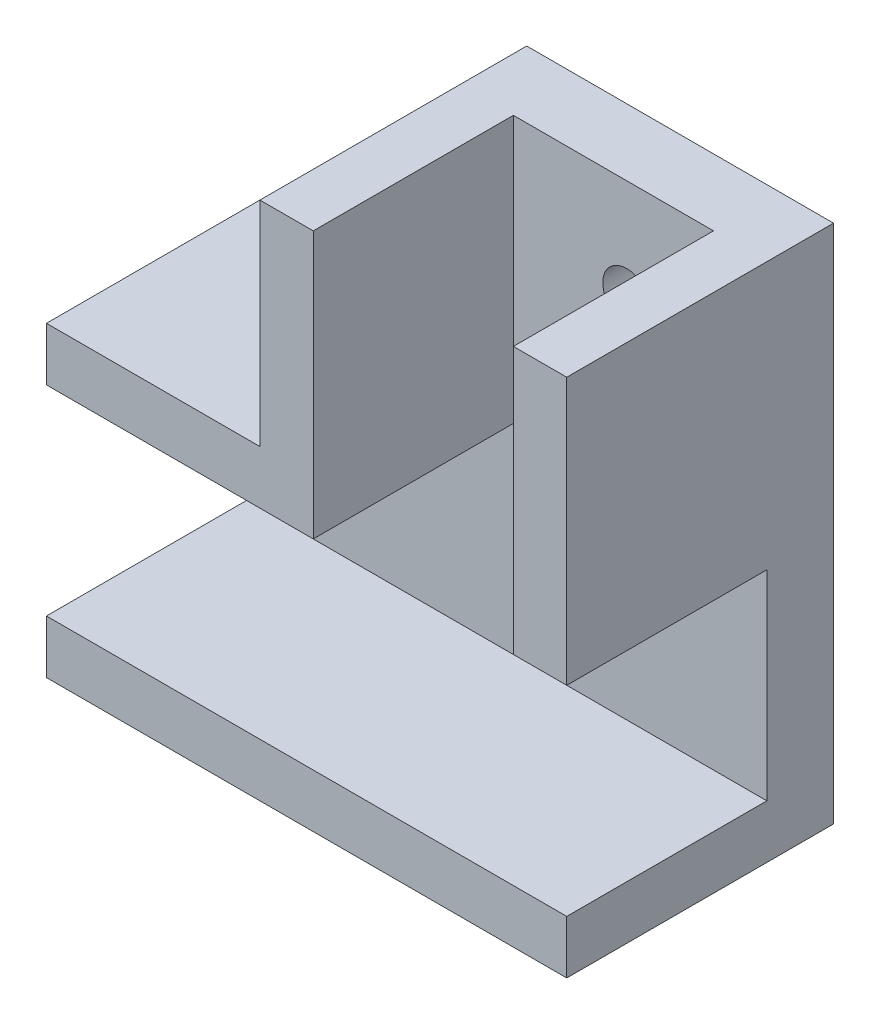
ISO-10303-21;
HEADER;
FILE_DESCRIPTION(('STEP AP214'),'2;1');
FILE_NAME('part.step','',(''),(''),'','','');
FILE_SCHEMA(('AUTOMOTIVE_DESIGN { 1 0 10303 214 1 1 1 1 }'));
ENDSEC;
DATA;
#1=APPLICATION_CONTEXT('core data for automotive mechanical design processes');
#2=APPLICATION_PROTOCOL_DEFINITION('international standard','automotive_design',2000,#1);
#3=PRODUCT_CONTEXT('',#1,'mechanical');
#4=PRODUCT('Part','Part','',(#3));
#5=PRODUCT_RELATED_PRODUCT_CATEGORY('part','',(#4));
#6=PRODUCT_DEFINITION_FORMATION('','',#4);
#7=PRODUCT_DEFINITION_CONTEXT('part definition',#1,'design');
#8=PRODUCT_DEFINITION('design','',#6,#7);
#9=PRODUCT_DEFINITION_SHAPE('','',#8);
#10=(LENGTH_UNIT() NAMED_UNIT(*) SI_UNIT(.MILLI.,.METRE.));
#11=(NAMED_UNIT(*) PLANE_ANGLE_UNIT() SI_UNIT($,.RADIAN.));
#12=(NAMED_UNIT(*) SI_UNIT($,.STERADIAN.) SOLID_ANGLE_UNIT());
#13=UNCERTAINTY_MEASURE_WITH_UNIT(LENGTH_MEASURE(1.E-05),#10,'distance_accuracy_value','');
#14=(GEOMETRIC_REPRESENTATION_CONTEXT(3) GLOBAL_UNCERTAINTY_ASSIGNED_CONTEXT((#13)) GLOBAL_UNIT_ASSIGNED_CONTEXT((#10,
#11,#12)) REPRESENTATION_CONTEXT('',''));
#15=CARTESIAN_POINT('',(0.,0.,0.));
#16=DIRECTION('',(0.,0.,1.));
#17=DIRECTION('',(1.,0.,0.));
#18=AXIS2_PLACEMENT_3D('',#15,#16,#17);
#19=CARTESIAN_POINT('',(0.,0.,20.));
#20=DIRECTION('',(0.,0.,-1.));
#21=DIRECTION('',(-1.,0.,0.));
#22=AXIS2_PLACEMENT_3D('',#19,#20,#21);
#23=PLANE('',#22);
#24=DIRECTION('',(0.,1.,0.));
#25=VECTOR('',#24,1.);
#26=CARTESIAN_POINT('',(14.3137254901961,15.7352941176471,20.));
#27=LINE('',#26,#25);
#28=CARTESIAN_POINT('',(14.3137254901961,-4.26470588235293,20.));
#29=VERTEX_POINT('',#28);
#30=CARTESIAN_POINT('',(14.3137254901961,15.7352941176471,20.));
#31=VERTEX_POINT('',#30);
#32=EDGE_CURVE('E163',#29,#31,#27,.T.);
#33=ORIENTED_EDGE('',*,*,#32,.F.);
#34=DIRECTION('',(-1.,0.,0.));
#35=VECTOR('',#34,1.);
#36=CARTESIAN_POINT('',(18.3137254901961,-4.26470588235293,20.));
#37=LINE('',#36,#35);
#38=CARTESIAN_POINT('',(18.3137254901961,-4.26470588235293,20.));
#39=VERTEX_POINT('',#38);
#40=EDGE_CURVE('E156',#39,#29,#37,.T.);
#41=ORIENTED_EDGE('',*,*,#40,.F.);
#42=DIRECTION('',(0.,-1.,0.));
#43=VECTOR('',#42,1.);
#44=CARTESIAN_POINT('',(18.3137254901961,15.7352941176471,20.));
#45=LINE('',#44,#43);
#46=CARTESIAN_POINT('',(18.3137254901961,15.7352941176471,20.));
#47=VERTEX_POINT('',#46);
#48=EDGE_CURVE('E169',#47,#39,#45,.T.);
#49=ORIENTED_EDGE('',*,*,#48,.F.);
#50=DIRECTION('',(1.,0.,0.));
#51=VECTOR('',#50,1.);
#52=CARTESIAN_POINT('',(14.3137254901961,15.7352941176471,20.));
#53=LINE('',#52,#51);
#54=EDGE_CURVE('E165',#31,#47,#53,.T.);
#55=ORIENTED_EDGE('',*,*,#54,.F.);
#56=EDGE_LOOP('',(#33,#41,#49,#55));
#57=FACE_BOUND('',#56,.T.);
#58=ADVANCED_FACE('F33',(#57),#23,.F.);
#59=CARTESIAN_POINT('',(-20.6862745098039,-4.26470588235294,5.));
#60=DIRECTION('',(1.,0.,0.));
#61=DIRECTION('',(0.,1.,0.));
#62=AXIS2_PLACEMENT_3D('',#59,#60,#61);
#63=PLANE('',#62);
#64=DIRECTION('',(0.,-1.,0.));
#65=VECTOR('',#64,1.);
#66=CARTESIAN_POINT('',(-20.6862745098039,-4.26470588235294,0.));
#67=LINE('',#66,#65);
#68=CARTESIAN_POINT('',(-20.6862745098039,-0.264705882352941,0.));
#69=VERTEX_POINT('',#68);
#70=CARTESIAN_POINT('',(-20.6862745098039,-23.2647058823529,0.));
#71=VERTEX_POINT('',#70);
#72=EDGE_CURVE('E234',#69,#71,#67,.T.);
#73=ORIENTED_EDGE('',*,*,#72,.T.);
#74=DIRECTION('',(0.,0.,-1.));
#75=VECTOR('',#74,1.);
#76=CARTESIAN_POINT('',(-20.6862745098039,-23.2647058823529,20.));
#77=LINE('',#76,#75);
#78=CARTESIAN_POINT('',(-20.6862745098039,-23.2647058823529,20.));
#79=VERTEX_POINT('',#78);
#80=EDGE_CURVE('E205',#79,#71,#77,.T.);
#81=ORIENTED_EDGE('',*,*,#80,.F.);
#82=DIRECTION('',(0.,1.,0.));
#83=VECTOR('',#82,1.);
#84=CARTESIAN_POINT('',(-20.6862745098039,-23.2647058823529,20.));
#85=LINE('',#84,#83);
#86=CARTESIAN_POINT('',(-20.6862745098039,-19.2647058823529,20.));
#87=VERTEX_POINT('',#86);
#88=EDGE_CURVE('E195',#79,#87,#85,.T.);
#89=ORIENTED_EDGE('',*,*,#88,.T.);
#90=DIRECTION('',(0.,0.,-1.));
#91=VECTOR('',#90,1.);
#92=CARTESIAN_POINT('',(-20.6862745098039,-19.2647058823529,20.));
#93=LINE('',#92,#91);
#94=CARTESIAN_POINT('',(-20.6862745098039,-19.2647058823529,5.));
#95=VERTEX_POINT('',#94);
#96=EDGE_CURVE('E202',#87,#95,#93,.T.);
#97=ORIENTED_EDGE('',*,*,#96,.T.);
#98=DIRECTION('',(0.,-1.,0.));
#99=VECTOR('',#98,1.);
#100=CARTESIAN_POINT('',(-20.6862745098039,-4.26470588235294,5.));
#101=LINE('',#100,#99);
#102=CARTESIAN_POINT('',(-20.6862745098039,-4.26470588235294,5.));
#103=VERTEX_POINT('',#102);
#104=EDGE_CURVE('E141',#103,#95,#101,.T.);
#105=ORIENTED_EDGE('',*,*,#104,.F.);
#106=DIRECTION('',(0.,0.,-1.));
#107=VECTOR('',#106,1.);
#108=CARTESIAN_POINT('',(-20.6862745098039,-4.26470588235294,20.));
#109=LINE('',#108,#107);
#110=CARTESIAN_POINT('',(-20.6862745098039,-4.26470588235294,20.));
#111=VERTEX_POINT('',#110);
#112=EDGE_CURVE('E231',#111,#103,#109,.T.);
#113=ORIENTED_EDGE('',*,*,#112,.F.);
#114=DIRECTION('',(0.,1.,0.));
#115=VECTOR('',#114,1.);
#116=CARTESIAN_POINT('',(-20.6862745098039,-4.26470588235294,20.));
#117=LINE('',#116,#115);
#118=CARTESIAN_POINT('',(-20.6862745098039,-0.264705882352941,20.));
#119=VERTEX_POINT('',#118);
#120=EDGE_CURVE('E210',#111,#119,#117,.T.);
#121=ORIENTED_EDGE('',*,*,#120,.T.);
#122=DIRECTION('',(0.,0.,-1.));
#123=VECTOR('',#122,1.);
#124=CARTESIAN_POINT('',(-20.6862745098039,-0.264705882352941,20.));
#125=LINE('',#124,#123);
#126=EDGE_CURVE('E226',#119,#69,#125,.T.);
#127=ORIENTED_EDGE('',*,*,#126,.T.);
#128=EDGE_LOOP('',(#73,#81,#89,#97,#105,#113,#121,#127));
#129=FACE_BOUND('',#128,.T.);
#130=ADVANCED_FACE('F35',(#129),#63,.F.);
#131=CARTESIAN_POINT('',(-0.686274509803913,15.7352941176471,5.));
#132=DIRECTION('',(0.,-1.,0.));
#133=DIRECTION('',(0.,0.,-1.));
#134=AXIS2_PLACEMENT_3D('',#131,#132,#133);
#135=PLANE('',#134);
#136=DIRECTION('',(-1.,0.,0.));
#137=VECTOR('',#136,1.);
#138=CARTESIAN_POINT('',(-0.686274509803913,15.7352941176471,0.));
#139=LINE('',#138,#137);
#140=CARTESIAN_POINT('',(18.3137254901961,15.7352941176471,0.));
#141=VERTEX_POINT('',#140);
#142=CARTESIAN_POINT('',(-4.68627450980391,15.7352941176471,0.));
#143=VERTEX_POINT('',#142);
#144=EDGE_CURVE('E37',#141,#143,#139,.T.);
#145=ORIENTED_EDGE('',*,*,#144,.T.);
#146=DIRECTION('',(0.,0.,-1.));
#147=VECTOR('',#146,1.);
#148=CARTESIAN_POINT('',(-4.68627450980391,15.7352941176471,20.));
#149=LINE('',#148,#147);
#150=CARTESIAN_POINT('',(-4.68627450980391,15.7352941176471,20.));
#151=VERTEX_POINT('',#150);
#152=EDGE_CURVE('E241',#151,#143,#149,.T.);
#153=ORIENTED_EDGE('',*,*,#152,.F.);
#154=DIRECTION('',(-1.,0.,0.));
#155=VECTOR('',#154,1.);
#156=CARTESIAN_POINT('',(-0.686274509803913,15.7352941176471,20.));
#157=LINE('',#156,#155);
#158=CARTESIAN_POINT('',(-0.686274509803913,15.7352941176471,20.));
#159=VERTEX_POINT('',#158);
#160=EDGE_CURVE('E219',#159,#151,#157,.T.);
#161=ORIENTED_EDGE('',*,*,#160,.F.);
#162=DIRECTION('',(0.,0.,-1.));
#163=VECTOR('',#162,1.);
#164=CARTESIAN_POINT('',(-0.686274509803913,15.7352941176471,20.));
#165=LINE('',#164,#163);
#166=CARTESIAN_POINT('',(-0.686274509803913,15.7352941176471,5.));
#167=VERTEX_POINT('',#166);
#168=EDGE_CURVE('E238',#159,#167,#165,.T.);
#169=ORIENTED_EDGE('',*,*,#168,.T.);
#170=DIRECTION('',(-1.,0.,0.));
#171=VECTOR('',#170,1.);
#172=CARTESIAN_POINT('',(-0.686274509803913,15.7352941176471,5.));
#173=LINE('',#172,#171);
#174=CARTESIAN_POINT('',(14.3137254901961,15.7352941176471,5.));
#175=VERTEX_POINT('',#174);
#176=EDGE_CURVE('E250',#175,#167,#173,.T.);
#177=ORIENTED_EDGE('',*,*,#176,.F.);
#178=DIRECTION('',(0.,0.,-1.));
#179=VECTOR('',#178,1.);
#180=CARTESIAN_POINT('',(14.3137254901961,15.7352941176471,20.));
#181=LINE('',#180,#179);
#182=EDGE_CURVE('E171',#31,#175,#181,.T.);
#183=ORIENTED_EDGE('',*,*,#182,.F.);
#184=ORIENTED_EDGE('',*,*,#54,.T.);
#185=DIRECTION('',(0.,0.,-1.));
#186=VECTOR('',#185,1.);
#187=CARTESIAN_POINT('',(18.3137254901961,15.7352941176471,20.));
#188=LINE('',#187,#186);
#189=EDGE_CURVE('E178',#47,#141,#188,.T.);
#190=ORIENTED_EDGE('',*,*,#189,.T.);
#191=EDGE_LOOP('',(#145,#153,#161,#169,#177,#183,#184,#190));
#192=FACE_BOUND('',#191,.T.);
#193=ADVANCED_FACE('F255',(#192),#135,.F.);
#194=CARTESIAN_POINT('',(0.,0.,5.));
#195=DIRECTION('',(0.,0.,1.));
#196=DIRECTION('',(1.,0.,0.));
#197=AXIS2_PLACEMENT_3D('',#194,#195,#196);
#198=PLANE('',#197);
#199=DIRECTION('',(0.,-1.,0.));
#200=VECTOR('',#199,1.);
#201=CARTESIAN_POINT('',(-0.686274509803913,15.7352941176471,5.));
#202=LINE('',#201,#200);
#203=CARTESIAN_POINT('',(-0.68627450980391,-4.26470588235294,5.));
#204=VERTEX_POINT('',#203);
#205=EDGE_CURVE('E42',#167,#204,#202,.T.);
#206=ORIENTED_EDGE('',*,*,#205,.T.);
#207=DIRECTION('',(-1.,0.,0.));
#208=VECTOR('',#207,1.);
#209=CARTESIAN_POINT('',(-20.6862745098039,-4.26470588235294,5.));
#210=LINE('',#209,#208);
#211=EDGE_CURVE('E11',#204,#103,#210,.T.);
#212=ORIENTED_EDGE('',*,*,#211,.T.);
#213=ORIENTED_EDGE('',*,*,#104,.T.);
#214=DIRECTION('',(1.,0.,0.));
#215=VECTOR('',#214,1.);
#216=CARTESIAN_POINT('',(-20.6862745098039,-19.2647058823529,5.));
#217=LINE('',#216,#215);
#218=CARTESIAN_POINT('',(18.3137254901961,-19.2647058823529,5.));
#219=VERTEX_POINT('',#218);
#220=EDGE_CURVE('E134',#95,#219,#217,.T.);
#221=ORIENTED_EDGE('',*,*,#220,.T.);
#222=DIRECTION('',(0.,-1.,0.));
#223=VECTOR('',#222,1.);
#224=CARTESIAN_POINT('',(18.3137254901961,-4.26470588235293,5.));
#225=LINE('',#224,#223);
#226=CARTESIAN_POINT('',(18.3137254901961,-4.26470588235293,5.));
#227=VERTEX_POINT('',#226);
#228=EDGE_CURVE('E139',#227,#219,#225,.T.);
#229=ORIENTED_EDGE('',*,*,#228,.F.);
#230=DIRECTION('',(-1.,0.,0.));
#231=VECTOR('',#230,1.);
#232=CARTESIAN_POINT('',(18.3137254901961,-4.26470588235293,5.));
#233=LINE('',#232,#231);
#234=CARTESIAN_POINT('',(14.3137254901961,-4.26470588235293,5.));
#235=VERTEX_POINT('',#234);
#236=EDGE_CURVE('E157',#227,#235,#233,.T.);
#237=ORIENTED_EDGE('',*,*,#236,.T.);
#238=DIRECTION('',(0.,1.,0.));
#239=VECTOR('',#238,1.);
#240=CARTESIAN_POINT('',(14.3137254901961,-4.26470588235294,5.));
#241=LINE('',#240,#239);
#242=EDGE_CURVE('E143',#235,#175,#241,.T.);
#243=ORIENTED_EDGE('',*,*,#242,.T.);
#244=ORIENTED_EDGE('',*,*,#176,.T.);
#245=EDGE_LOOP('',(#206,#212,#213,#221,#229,#237,#243,#244));
#246=FACE_BOUND('',#245,.T.);
#247=CARTESIAN_POINT('',(7.81372549019609,8.23529411764706,5.));
#248=DIRECTION('',(0.,0.,1.));
#249=DIRECTION('',(1.,0.,0.));
#250=AXIS2_PLACEMENT_3D('',#247,#248,#249);
#251=CIRCLE('',#250,1.8);
#252=CARTESIAN_POINT('',(9.61372549019609,8.23529411764706,5.));
#253=VERTEX_POINT('',#252);
#254=EDGE_CURVE('E187',#253,#253,#251,.T.);
#255=ORIENTED_EDGE('',*,*,#254,.F.);
#256=EDGE_LOOP('',(#255));
#257=FACE_BOUND('',#256,.T.);
#258=CARTESIAN_POINT('',(-13.1862745098039,-11.7647058823529,5.));
#259=DIRECTION('',(0.,0.,1.));
#260=DIRECTION('',(1.,0.,0.));
#261=AXIS2_PLACEMENT_3D('',#258,#259,#260);
#262=CIRCLE('',#261,1.8);
#263=CARTESIAN_POINT('',(-11.3862745098039,-11.7647058823529,5.));
#264=VERTEX_POINT('',#263);
#265=EDGE_CURVE('E177',#264,#264,#262,.T.);
#266=ORIENTED_EDGE('',*,*,#265,.F.);
#267=EDGE_LOOP('',(#266));
#268=FACE_BOUND('',#267,.T.);
#269=ADVANCED_FACE('F135',(#246,#257,#268),#198,.T.);
#270=CARTESIAN_POINT('',(0.,0.,0.));
#271=DIRECTION('',(0.,0.,1.));
#272=DIRECTION('',(1.,0.,0.));
#273=AXIS2_PLACEMENT_3D('',#270,#271,#272);
#274=PLANE('',#273);
#275=CARTESIAN_POINT('',(7.81372549019609,8.23529411764706,0.));
#276=DIRECTION('',(0.,0.,1.));
#277=DIRECTION('',(1.,0.,0.));
#278=AXIS2_PLACEMENT_3D('',#275,#276,#277);
#279=CIRCLE('',#278,1.8);
#280=CARTESIAN_POINT('',(9.61372549019609,8.23529411764706,0.));
#281=VERTEX_POINT('',#280);
#282=EDGE_CURVE('E183',#281,#281,#279,.T.);
#283=ORIENTED_EDGE('',*,*,#282,.T.);
#284=EDGE_LOOP('',(#283));
#285=FACE_BOUND('',#284,.T.);
#286=CARTESIAN_POINT('',(-13.1862745098039,-11.7647058823529,0.));
#287=DIRECTION('',(0.,0.,1.));
#288=DIRECTION('',(1.,0.,0.));
#289=AXIS2_PLACEMENT_3D('',#286,#287,#288);
#290=CIRCLE('',#289,1.8);
#291=CARTESIAN_POINT('',(-11.3862745098039,-11.7647058823529,0.));
#292=VERTEX_POINT('',#291);
#293=EDGE_CURVE('E190',#292,#292,#290,.T.);
#294=ORIENTED_EDGE('',*,*,#293,.T.);
#295=EDGE_LOOP('',(#294));
#296=FACE_BOUND('',#295,.T.);
#297=ORIENTED_EDGE('',*,*,#72,.F.);
#298=DIRECTION('',(1.,0.,0.));
#299=VECTOR('',#298,1.);
#300=CARTESIAN_POINT('',(-6.07997052750672,-0.264705882352943,0.));
#301=LINE('',#300,#299);
#302=CARTESIAN_POINT('',(-4.68627450980391,-0.264705882352945,0.));
#303=VERTEX_POINT('',#302);
#304=EDGE_CURVE('E208',#69,#303,#301,.T.);
#305=ORIENTED_EDGE('',*,*,#304,.T.);
#306=DIRECTION('',(0.,-1.,0.));
#307=VECTOR('',#306,1.);
#308=CARTESIAN_POINT('',(-4.68627450980391,15.7352941176471,0.));
#309=LINE('',#308,#307);
#310=EDGE_CURVE('E214',#143,#303,#309,.T.);
#311=ORIENTED_EDGE('',*,*,#310,.F.);
#312=ORIENTED_EDGE('',*,*,#144,.F.);
#313=DIRECTION('',(0.,-1.,0.));
#314=VECTOR('',#313,1.);
#315=CARTESIAN_POINT('',(18.3137254901961,15.7352941176471,0.));
#316=LINE('',#315,#314);
#317=CARTESIAN_POINT('',(18.3137254901961,-23.2647058823529,0.));
#318=VERTEX_POINT('',#317);
#319=EDGE_CURVE('E162',#141,#318,#316,.T.);
#320=ORIENTED_EDGE('',*,*,#319,.T.);
#321=DIRECTION('',(-1.,0.,0.));
#322=VECTOR('',#321,1.);
#323=CARTESIAN_POINT('',(14.3137254901961,-23.2647058823529,0.));
#324=LINE('',#323,#322);
#325=EDGE_CURVE('E186',#318,#71,#324,.T.);
#326=ORIENTED_EDGE('',*,*,#325,.T.);
#327=EDGE_LOOP('',(#297,#305,#311,#312,#320,#326));
#328=FACE_BOUND('',#327,.T.);
#329=ADVANCED_FACE('F264',(#285,#296,#328),#274,.F.);
#330=CARTESIAN_POINT('',(-20.6862745098039,-4.26470588235294,20.));
#331=DIRECTION('',(0.,1.,0.));
#332=DIRECTION('',(-1.,0.,0.));
#333=AXIS2_PLACEMENT_3D('',#330,#331,#332);
#334=PLANE('',#333);
#335=ORIENTED_EDGE('',*,*,#211,.F.);
#336=DIRECTION('',(0.,0.,-1.));
#337=VECTOR('',#336,1.);
#338=CARTESIAN_POINT('',(-0.686274509803916,-4.26470588235294,20.));
#339=LINE('',#338,#337);
#340=CARTESIAN_POINT('',(-0.686274509803916,-4.26470588235294,20.));
#341=VERTEX_POINT('',#340);
#342=EDGE_CURVE('E235',#341,#204,#339,.T.);
#343=ORIENTED_EDGE('',*,*,#342,.F.);
#344=DIRECTION('',(1.,0.,0.));
#345=VECTOR('',#344,1.);
#346=CARTESIAN_POINT('',(-20.6862745098039,-4.26470588235294,20.));
#347=LINE('',#346,#345);
#348=EDGE_CURVE('E224',#111,#341,#347,.T.);
#349=ORIENTED_EDGE('',*,*,#348,.F.);
#350=ORIENTED_EDGE('',*,*,#112,.T.);
#351=EDGE_LOOP('',(#335,#343,#349,#350));
#352=FACE_BOUND('',#351,.T.);
#353=ADVANCED_FACE('F281',(#352),#334,.F.);
#354=CARTESIAN_POINT('',(-0.686274509803913,15.7352941176471,20.));
#355=DIRECTION('',(1.,0.,0.));
#356=DIRECTION('',(0.,1.,0.));
#357=AXIS2_PLACEMENT_3D('',#354,#355,#356);
#358=PLANE('',#357);
#359=ORIENTED_EDGE('',*,*,#342,.T.);
#360=ORIENTED_EDGE('',*,*,#205,.F.);
#361=ORIENTED_EDGE('',*,*,#168,.F.);
#362=DIRECTION('',(0.,-1.,0.));
#363=VECTOR('',#362,1.);
#364=CARTESIAN_POINT('',(-0.686274509803913,15.7352941176471,20.));
#365=LINE('',#364,#363);
#366=EDGE_CURVE('E221',#159,#341,#365,.T.);
#367=ORIENTED_EDGE('',*,*,#366,.T.);
#368=EDGE_LOOP('',(#359,#360,#361,#367));
#369=FACE_BOUND('',#368,.T.);
#370=ADVANCED_FACE('F279',(#369),#358,.T.);
#371=CARTESIAN_POINT('',(-4.68627450980391,15.7352941176471,20.));
#372=DIRECTION('',(1.,0.,0.));
#373=DIRECTION('',(0.,1.,0.));
#374=AXIS2_PLACEMENT_3D('',#371,#372,#373);
#375=PLANE('',#374);
#376=ORIENTED_EDGE('',*,*,#310,.T.);
#377=DIRECTION('',(0.,0.,-1.));
#378=VECTOR('',#377,1.);
#379=CARTESIAN_POINT('',(-4.68627450980391,-0.264705882352945,20.));
#380=LINE('',#379,#378);
#381=CARTESIAN_POINT('',(-4.68627450980391,-0.264705882352945,20.));
#382=VERTEX_POINT('',#381);
#383=EDGE_CURVE('E244',#382,#303,#380,.T.);
#384=ORIENTED_EDGE('',*,*,#383,.F.);
#385=DIRECTION('',(0.,-1.,0.));
#386=VECTOR('',#385,1.);
#387=CARTESIAN_POINT('',(-4.68627450980391,15.7352941176471,20.));
#388=LINE('',#387,#386);
#389=EDGE_CURVE('E216',#151,#382,#388,.T.);
#390=ORIENTED_EDGE('',*,*,#389,.F.);
#391=ORIENTED_EDGE('',*,*,#152,.T.);
#392=EDGE_LOOP('',(#376,#384,#390,#391));
#393=FACE_BOUND('',#392,.T.);
#394=ADVANCED_FACE('F262',(#393),#375,.F.);
#395=CARTESIAN_POINT('',(-6.07997052750672,-0.264705882352943,20.));
#396=DIRECTION('',(0.,1.,0.));
#397=DIRECTION('',(-1.,0.,0.));
#398=AXIS2_PLACEMENT_3D('',#395,#396,#397);
#399=PLANE('',#398);
#400=ORIENTED_EDGE('',*,*,#304,.F.);
#401=ORIENTED_EDGE('',*,*,#126,.F.);
#402=DIRECTION('',(1.,0.,0.));
#403=VECTOR('',#402,1.);
#404=CARTESIAN_POINT('',(-20.6862745098039,-0.264705882352941,20.));
#405=LINE('',#404,#403);
#406=EDGE_CURVE('E213',#119,#382,#405,.T.);
#407=ORIENTED_EDGE('',*,*,#406,.T.);
#408=ORIENTED_EDGE('',*,*,#383,.T.);
#409=EDGE_LOOP('',(#400,#401,#407,#408));
#410=FACE_BOUND('',#409,.T.);
#411=ADVANCED_FACE('F267',(#410),#399,.T.);
#412=CARTESIAN_POINT('',(0.,0.,20.));
#413=DIRECTION('',(0.,0.,-1.));
#414=DIRECTION('',(-1.,0.,0.));
#415=AXIS2_PLACEMENT_3D('',#412,#413,#414);
#416=PLANE('',#415);
#417=ORIENTED_EDGE('',*,*,#120,.F.);
#418=ORIENTED_EDGE('',*,*,#348,.T.);
#419=ORIENTED_EDGE('',*,*,#366,.F.);
#420=ORIENTED_EDGE('',*,*,#160,.T.);
#421=ORIENTED_EDGE('',*,*,#389,.T.);
#422=ORIENTED_EDGE('',*,*,#406,.F.);
#423=EDGE_LOOP('',(#417,#418,#419,#420,#421,#422));
#424=FACE_BOUND('',#423,.T.);
#425=ADVANCED_FACE('F272',(#424),#416,.F.);
#426=CARTESIAN_POINT('',(-20.6862745098039,-19.2647058823529,20.));
#427=DIRECTION('',(0.,1.,0.));
#428=DIRECTION('',(0.,0.,1.));
#429=AXIS2_PLACEMENT_3D('',#426,#427,#428);
#430=PLANE('',#429);
#431=ORIENTED_EDGE('',*,*,#220,.F.);
#432=ORIENTED_EDGE('',*,*,#96,.F.);
#433=DIRECTION('',(1.,0.,0.));
#434=VECTOR('',#433,1.);
#435=CARTESIAN_POINT('',(-20.6862745098039,-19.2647058823529,20.));
#436=LINE('',#435,#434);
#437=CARTESIAN_POINT('',(18.3137254901961,-19.2647058823529,20.));
#438=VERTEX_POINT('',#437);
#439=EDGE_CURVE('E50',#87,#438,#436,.T.);
#440=ORIENTED_EDGE('',*,*,#439,.T.);
#441=DIRECTION('',(0.,0.,1.));
#442=VECTOR('',#441,1.);
#443=CARTESIAN_POINT('',(18.3137254901961,-19.2647058823529,5.));
#444=LINE('',#443,#442);
#445=EDGE_CURVE('E145',#219,#438,#444,.T.);
#446=ORIENTED_EDGE('',*,*,#445,.F.);
#447=EDGE_LOOP('',(#431,#432,#440,#446));
#448=FACE_BOUND('',#447,.T.);
#449=ADVANCED_FACE('F146',(#448),#430,.T.);
#450=CARTESIAN_POINT('',(14.3137254901961,-23.2647058823529,20.));
#451=DIRECTION('',(0.,-1.,0.));
#452=DIRECTION('',(0.,0.,-1.));
#453=AXIS2_PLACEMENT_3D('',#450,#451,#452);
#454=PLANE('',#453);
#455=ORIENTED_EDGE('',*,*,#325,.F.);
#456=DIRECTION('',(0.,0.,-1.));
#457=VECTOR('',#456,1.);
#458=CARTESIAN_POINT('',(18.3137254901961,-23.2647058823529,20.));
#459=LINE('',#458,#457);
#460=CARTESIAN_POINT('',(18.3137254901961,-23.2647058823529,20.));
#461=VERTEX_POINT('',#460);
#462=EDGE_CURVE('E174',#461,#318,#459,.T.);
#463=ORIENTED_EDGE('',*,*,#462,.F.);
#464=DIRECTION('',(-1.,0.,0.));
#465=VECTOR('',#464,1.);
#466=CARTESIAN_POINT('',(14.3137254901961,-23.2647058823529,20.));
#467=LINE('',#466,#465);
#468=EDGE_CURVE('E199',#461,#79,#467,.T.);
#469=ORIENTED_EDGE('',*,*,#468,.T.);
#470=ORIENTED_EDGE('',*,*,#80,.T.);
#471=EDGE_LOOP('',(#455,#463,#469,#470));
#472=FACE_BOUND('',#471,.T.);
#473=ADVANCED_FACE('F306',(#472),#454,.T.);
#474=EDGE_CURVE('E168',#438,#461,#45,.T.);
#475=ORIENTED_EDGE('',*,*,#474,.F.);
#476=ORIENTED_EDGE('',*,*,#439,.F.);
#477=ORIENTED_EDGE('',*,*,#88,.F.);
#478=ORIENTED_EDGE('',*,*,#468,.F.);
#479=EDGE_LOOP('',(#475,#476,#477,#478));
#480=FACE_BOUND('',#479,.T.);
#481=ADVANCED_FACE('F295',(#480),#23,.F.);
#482=CARTESIAN_POINT('',(-13.1862745098039,-11.7647058823529,0.));
#483=DIRECTION('',(0.,0.,1.));
#484=DIRECTION('',(1.,0.,0.));
#485=AXIS2_PLACEMENT_3D('',#482,#483,#484);
#486=CYLINDRICAL_SURFACE('',#485,1.8);
#487=ORIENTED_EDGE('',*,*,#293,.F.);
#488=EDGE_LOOP('',(#487));
#489=FACE_BOUND('',#488,.T.);
#490=ORIENTED_EDGE('',*,*,#265,.T.);
#491=EDGE_LOOP('',(#490));
#492=FACE_BOUND('',#491,.T.);
#493=ADVANCED_FACE('F305',(#489,#492),#486,.F.);
#494=CARTESIAN_POINT('',(7.81372549019609,8.23529411764706,0.));
#495=DIRECTION('',(0.,0.,1.));
#496=DIRECTION('',(1.,0.,0.));
#497=AXIS2_PLACEMENT_3D('',#494,#495,#496);
#498=CYLINDRICAL_SURFACE('',#497,1.8);
#499=ORIENTED_EDGE('',*,*,#282,.F.);
#500=EDGE_LOOP('',(#499));
#501=FACE_BOUND('',#500,.T.);
#502=ORIENTED_EDGE('',*,*,#254,.T.);
#503=EDGE_LOOP('',(#502));
#504=FACE_BOUND('',#503,.T.);
#505=ADVANCED_FACE('F313',(#501,#504),#498,.F.);
#506=CARTESIAN_POINT('',(14.3137254901961,15.7352941176471,20.));
#507=DIRECTION('',(-1.,0.,0.));
#508=DIRECTION('',(0.,-1.,0.));
#509=AXIS2_PLACEMENT_3D('',#506,#507,#508);
#510=PLANE('',#509);
#511=DIRECTION('',(0.,0.,-1.));
#512=VECTOR('',#511,1.);
#513=CARTESIAN_POINT('',(14.3137254901961,-4.26470588235293,20.));
#514=LINE('',#513,#512);
#515=EDGE_CURVE('E159',#29,#235,#514,.T.);
#516=ORIENTED_EDGE('',*,*,#515,.F.);
#517=ORIENTED_EDGE('',*,*,#32,.T.);
#518=ORIENTED_EDGE('',*,*,#182,.T.);
#519=ORIENTED_EDGE('',*,*,#242,.F.);
#520=EDGE_LOOP('',(#516,#517,#518,#519));
#521=FACE_BOUND('',#520,.T.);
#522=ADVANCED_FACE('F326',(#521),#510,.T.);
#523=CARTESIAN_POINT('',(18.3137254901961,15.7352941176471,20.));
#524=DIRECTION('',(1.,0.,0.));
#525=DIRECTION('',(0.,1.,0.));
#526=AXIS2_PLACEMENT_3D('',#523,#524,#525);
#527=PLANE('',#526);
#528=DIRECTION('',(0.,0.,-1.));
#529=VECTOR('',#528,1.);
#530=CARTESIAN_POINT('',(18.3137254901961,-4.26470588235293,5.));
#531=LINE('',#530,#529);
#532=EDGE_CURVE('E149',#39,#227,#531,.T.);
#533=ORIENTED_EDGE('',*,*,#532,.T.);
#534=ORIENTED_EDGE('',*,*,#228,.T.);
#535=ORIENTED_EDGE('',*,*,#445,.T.);
#536=ORIENTED_EDGE('',*,*,#474,.T.);
#537=ORIENTED_EDGE('',*,*,#462,.T.);
#538=ORIENTED_EDGE('',*,*,#319,.F.);
#539=ORIENTED_EDGE('',*,*,#189,.F.);
#540=ORIENTED_EDGE('',*,*,#48,.T.);
#541=EDGE_LOOP('',(#533,#534,#535,#536,#537,#538,#539,#540));
#542=FACE_BOUND('',#541,.T.);
#543=ADVANCED_FACE('F151',(#542),#527,.T.);
#544=CARTESIAN_POINT('',(18.3137254901961,-4.26470588235293,5.));
#545=DIRECTION('',(0.,1.,0.));
#546=DIRECTION('',(-1.,0.,0.));
#547=AXIS2_PLACEMENT_3D('',#544,#545,#546);
#548=PLANE('',#547);
#549=ORIENTED_EDGE('',*,*,#515,.T.);
#550=ORIENTED_EDGE('',*,*,#236,.F.);
#551=ORIENTED_EDGE('',*,*,#532,.F.);
#552=ORIENTED_EDGE('',*,*,#40,.T.);
#553=EDGE_LOOP('',(#549,#550,#551,#552));
#554=FACE_BOUND('',#553,.T.);
#555=ADVANCED_FACE('F328',(#554),#548,.F.);
#556=CLOSED_SHELL('',(#58,#130,#193,#269,#329,#353,#370,#394,#411,#425,#449,#473,#481,#493,#505,
#522,#543,#555));
#557=MANIFOLD_SOLID_BREP('B2',#556);
#558=ADVANCED_BREP_SHAPE_REPRESENTATION('',(#18,#557),#14);
#559=SHAPE_DEFINITION_REPRESENTATION(#9,#558);
ENDSEC;
END-ISO-10303-21;
